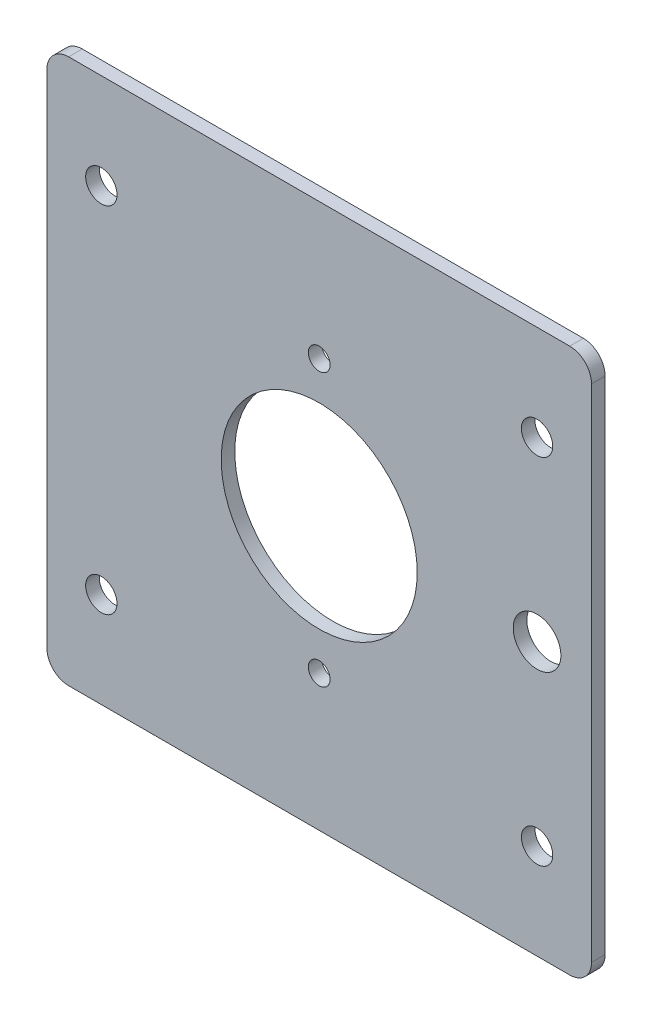
ISO-10303-21;
HEADER;
FILE_DESCRIPTION(('STEP AP214'),'2;1');
FILE_NAME('part.step','',(''),(''),'','','');
FILE_SCHEMA(('AUTOMOTIVE_DESIGN { 1 0 10303 214 1 1 1 1 }'));
ENDSEC;
DATA;
#1=APPLICATION_CONTEXT('core data for automotive mechanical design processes');
#2=APPLICATION_PROTOCOL_DEFINITION('international standard','automotive_design',2000,#1);
#3=PRODUCT_CONTEXT('',#1,'mechanical');
#4=PRODUCT('Part','Part','',(#3));
#5=PRODUCT_RELATED_PRODUCT_CATEGORY('part','',(#4));
#6=PRODUCT_DEFINITION_FORMATION('','',#4);
#7=PRODUCT_DEFINITION_CONTEXT('part definition',#1,'design');
#8=PRODUCT_DEFINITION('design','',#6,#7);
#9=PRODUCT_DEFINITION_SHAPE('','',#8);
#10=(LENGTH_UNIT() NAMED_UNIT(*) SI_UNIT(.MILLI.,.METRE.));
#11=(NAMED_UNIT(*) PLANE_ANGLE_UNIT() SI_UNIT($,.RADIAN.));
#12=(NAMED_UNIT(*) SI_UNIT($,.STERADIAN.) SOLID_ANGLE_UNIT());
#13=UNCERTAINTY_MEASURE_WITH_UNIT(LENGTH_MEASURE(1.E-05),#10,'distance_accuracy_value','');
#14=(GEOMETRIC_REPRESENTATION_CONTEXT(3) GLOBAL_UNCERTAINTY_ASSIGNED_CONTEXT((#13)) GLOBAL_UNIT_ASSIGNED_CONTEXT((#10,
#11,#12)) REPRESENTATION_CONTEXT('',''));
#15=CARTESIAN_POINT('',(0.,0.,0.));
#16=DIRECTION('',(0.,0.,1.));
#17=DIRECTION('',(1.,0.,0.));
#18=AXIS2_PLACEMENT_3D('',#15,#16,#17);
#19=CARTESIAN_POINT('',(31.75,31.75,-1.5875));
#20=DIRECTION('',(0.,0.,1.));
#21=DIRECTION('',(1.,0.,0.));
#22=AXIS2_PLACEMENT_3D('',#19,#20,#21);
#23=PLANE('',#22);
#24=CARTESIAN_POINT('',(25.4,0.,-1.5875));
#25=DIRECTION('',(0.,0.,1.));
#26=DIRECTION('',(1.,0.,0.));
#27=AXIS2_PLACEMENT_3D('',#24,#25,#26);
#28=CIRCLE('',#27,2.77812499999999);
#29=CARTESIAN_POINT('',(28.178125,0.,-1.5875));
#30=VERTEX_POINT('',#29);
#31=EDGE_CURVE('E216',#30,#30,#28,.T.);
#32=ORIENTED_EDGE('',*,*,#31,.T.);
#33=EDGE_LOOP('',(#32));
#34=FACE_BOUND('',#33,.T.);
#35=CARTESIAN_POINT('',(0.,-15.875,-1.5875));
#36=DIRECTION('',(0.,0.,1.));
#37=DIRECTION('',(-1.,0.,0.));
#38=AXIS2_PLACEMENT_3D('',#35,#36,#37);
#39=CIRCLE('',#38,1.27);
#40=CARTESIAN_POINT('',(-1.27,-15.875,-1.5875));
#41=VERTEX_POINT('',#40);
#42=EDGE_CURVE('E212',#41,#41,#39,.T.);
#43=ORIENTED_EDGE('',*,*,#42,.T.);
#44=EDGE_LOOP('',(#43));
#45=FACE_BOUND('',#44,.T.);
#46=CARTESIAN_POINT('',(0.,15.875,-1.5875));
#47=DIRECTION('',(0.,0.,1.));
#48=DIRECTION('',(1.,0.,0.));
#49=AXIS2_PLACEMENT_3D('',#46,#47,#48);
#50=CIRCLE('',#49,1.27);
#51=CARTESIAN_POINT('',(1.27,15.875,-1.5875));
#52=VERTEX_POINT('',#51);
#53=EDGE_CURVE('E219',#52,#52,#50,.T.);
#54=ORIENTED_EDGE('',*,*,#53,.T.);
#55=EDGE_LOOP('',(#54));
#56=FACE_BOUND('',#55,.T.);
#57=CARTESIAN_POINT('',(0.,0.,-1.5875));
#58=DIRECTION('',(0.,0.,1.));
#59=DIRECTION('',(1.,0.,0.));
#60=AXIS2_PLACEMENT_3D('',#57,#58,#59);
#61=CIRCLE('',#60,11.43);
#62=CARTESIAN_POINT('',(11.43,0.,-1.5875));
#63=VERTEX_POINT('',#62);
#64=EDGE_CURVE('E205',#63,#63,#61,.T.);
#65=ORIENTED_EDGE('',*,*,#64,.T.);
#66=EDGE_LOOP('',(#65));
#67=FACE_BOUND('',#66,.T.);
#68=CARTESIAN_POINT('',(-25.4,20.6375,-1.5875));
#69=DIRECTION('',(0.,0.,1.));
#70=DIRECTION('',(1.,0.,0.));
#71=AXIS2_PLACEMENT_3D('',#68,#69,#70);
#72=CIRCLE('',#71,1.8288);
#73=CARTESIAN_POINT('',(-23.5712,20.6375,-1.5875));
#74=VERTEX_POINT('',#73);
#75=EDGE_CURVE('E199',#74,#74,#72,.T.);
#76=ORIENTED_EDGE('',*,*,#75,.T.);
#77=EDGE_LOOP('',(#76));
#78=FACE_BOUND('',#77,.T.);
#79=CARTESIAN_POINT('',(25.4,20.6375,-1.5875));
#80=DIRECTION('',(0.,0.,1.));
#81=DIRECTION('',(1.,0.,0.));
#82=AXIS2_PLACEMENT_3D('',#79,#80,#81);
#83=CIRCLE('',#82,1.8288);
#84=CARTESIAN_POINT('',(27.2288,20.6375,-1.5875));
#85=VERTEX_POINT('',#84);
#86=EDGE_CURVE('E193',#85,#85,#83,.T.);
#87=ORIENTED_EDGE('',*,*,#86,.T.);
#88=EDGE_LOOP('',(#87));
#89=FACE_BOUND('',#88,.T.);
#90=CARTESIAN_POINT('',(25.4,-20.6375,-1.5875));
#91=DIRECTION('',(0.,0.,1.));
#92=DIRECTION('',(1.,0.,0.));
#93=AXIS2_PLACEMENT_3D('',#90,#91,#92);
#94=CIRCLE('',#93,1.8288);
#95=CARTESIAN_POINT('',(27.2288,-20.6375,-1.5875));
#96=VERTEX_POINT('',#95);
#97=EDGE_CURVE('E187',#96,#96,#94,.T.);
#98=ORIENTED_EDGE('',*,*,#97,.T.);
#99=EDGE_LOOP('',(#98));
#100=FACE_BOUND('',#99,.T.);
#101=CARTESIAN_POINT('',(-25.4,-20.6375,-1.5875));
#102=DIRECTION('',(0.,0.,1.));
#103=DIRECTION('',(1.,0.,0.));
#104=AXIS2_PLACEMENT_3D('',#101,#102,#103);
#105=CIRCLE('',#104,1.8288);
#106=CARTESIAN_POINT('',(-23.5712,-20.6375,-1.5875));
#107=VERTEX_POINT('',#106);
#108=EDGE_CURVE('E128',#107,#107,#105,.T.);
#109=ORIENTED_EDGE('',*,*,#108,.T.);
#110=EDGE_LOOP('',(#109));
#111=FACE_BOUND('',#110,.T.);
#112=DIRECTION('',(0.,-1.,0.));
#113=VECTOR('',#112,1.);
#114=CARTESIAN_POINT('',(31.75,31.75,-1.5875));
#115=LINE('',#114,#113);
#116=CARTESIAN_POINT('',(31.75,29.21,-1.5875));
#117=VERTEX_POINT('',#116);
#118=CARTESIAN_POINT('',(31.75,-29.21,-1.5875));
#119=VERTEX_POINT('',#118);
#120=EDGE_CURVE('E111',#117,#119,#115,.T.);
#121=ORIENTED_EDGE('',*,*,#120,.T.);
#122=CARTESIAN_POINT('',(29.21,-29.21,-1.5875));
#123=DIRECTION('',(0.,0.,1.));
#124=DIRECTION('',(1.,0.,0.));
#125=AXIS2_PLACEMENT_3D('',#122,#123,#124);
#126=CIRCLE('',#125,2.54);
#127=CARTESIAN_POINT('',(29.21,-31.75,-1.5875));
#128=VERTEX_POINT('',#127);
#129=EDGE_CURVE('E107',#119,#128,#126,.F.);
#130=ORIENTED_EDGE('',*,*,#129,.T.);
#131=DIRECTION('',(-1.,0.,0.));
#132=VECTOR('',#131,1.);
#133=CARTESIAN_POINT('',(31.75,-31.75,-1.5875));
#134=LINE('',#133,#132);
#135=CARTESIAN_POINT('',(-29.21,-31.75,-1.58749999999999));
#136=VERTEX_POINT('',#135);
#137=EDGE_CURVE('E109',#128,#136,#134,.T.);
#138=ORIENTED_EDGE('',*,*,#137,.T.);
#139=CARTESIAN_POINT('',(-29.21,-29.21,-1.58749999999999));
#140=DIRECTION('',(0.,0.,1.));
#141=DIRECTION('',(1.,0.,0.));
#142=AXIS2_PLACEMENT_3D('',#139,#140,#141);
#143=CIRCLE('',#142,2.54);
#144=CARTESIAN_POINT('',(-31.75,-29.21,-1.58749999999999));
#145=VERTEX_POINT('',#144);
#146=EDGE_CURVE('E116',#136,#145,#143,.F.);
#147=ORIENTED_EDGE('',*,*,#146,.T.);
#148=DIRECTION('',(0.,-1.,0.));
#149=VECTOR('',#148,1.);
#150=CARTESIAN_POINT('',(-31.75,31.75,-1.58749999999999));
#151=LINE('',#150,#149);
#152=CARTESIAN_POINT('',(-31.75,29.21,-1.58749999999999));
#153=VERTEX_POINT('',#152);
#154=EDGE_CURVE('E136',#153,#145,#151,.T.);
#155=ORIENTED_EDGE('',*,*,#154,.F.);
#156=CARTESIAN_POINT('',(-29.21,29.21,-1.58749999999999));
#157=DIRECTION('',(0.,0.,1.));
#158=DIRECTION('',(1.,0.,0.));
#159=AXIS2_PLACEMENT_3D('',#156,#157,#158);
#160=CIRCLE('',#159,2.54);
#161=CARTESIAN_POINT('',(-29.21,31.75,-1.58749999999999));
#162=VERTEX_POINT('',#161);
#163=EDGE_CURVE('E58',#153,#162,#160,.F.);
#164=ORIENTED_EDGE('',*,*,#163,.T.);
#165=DIRECTION('',(-1.,0.,0.));
#166=VECTOR('',#165,1.);
#167=CARTESIAN_POINT('',(31.75,31.75,-1.5875));
#168=LINE('',#167,#166);
#169=CARTESIAN_POINT('',(29.21,31.75,-1.5875));
#170=VERTEX_POINT('',#169);
#171=EDGE_CURVE('E178',#170,#162,#168,.T.);
#172=ORIENTED_EDGE('',*,*,#171,.F.);
#173=CARTESIAN_POINT('',(29.21,29.21,-1.5875));
#174=DIRECTION('',(0.,0.,1.));
#175=DIRECTION('',(1.,0.,0.));
#176=AXIS2_PLACEMENT_3D('',#173,#174,#175);
#177=CIRCLE('',#176,2.54);
#178=EDGE_CURVE('E149',#170,#117,#177,.F.);
#179=ORIENTED_EDGE('',*,*,#178,.T.);
#180=EDGE_LOOP('',(#121,#130,#138,#147,#155,#164,#172,#179));
#181=FACE_BOUND('',#180,.T.);
#182=ADVANCED_FACE('F43',(#34,#45,#56,#67,#78,#89,#100,#111,#181),#23,.F.);
#183=CARTESIAN_POINT('',(-31.75,31.75,0.));
#184=DIRECTION('',(-1.,0.,0.));
#185=DIRECTION('',(0.,0.,1.));
#186=AXIS2_PLACEMENT_3D('',#183,#184,#185);
#187=PLANE('',#186);
#188=ORIENTED_EDGE('',*,*,#154,.T.);
#189=DIRECTION('',(0.,0.,-1.));
#190=VECTOR('',#189,1.);
#191=CARTESIAN_POINT('',(-31.75,-29.21,0.));
#192=LINE('',#191,#190);
#193=CARTESIAN_POINT('',(-31.75,-29.21,0.));
#194=VERTEX_POINT('',#193);
#195=EDGE_CURVE('E155',#145,#194,#192,.F.);
#196=ORIENTED_EDGE('',*,*,#195,.T.);
#197=DIRECTION('',(0.,-1.,0.));
#198=VECTOR('',#197,1.);
#199=CARTESIAN_POINT('',(-31.75,31.75,0.));
#200=LINE('',#199,#198);
#201=CARTESIAN_POINT('',(-31.75,29.21,0.));
#202=VERTEX_POINT('',#201);
#203=EDGE_CURVE('E162',#202,#194,#200,.T.);
#204=ORIENTED_EDGE('',*,*,#203,.F.);
#205=DIRECTION('',(0.,0.,-1.));
#206=VECTOR('',#205,1.);
#207=CARTESIAN_POINT('',(-31.75,29.21,-1.58749999999999));
#208=LINE('',#207,#206);
#209=EDGE_CURVE('E115',#202,#153,#208,.T.);
#210=ORIENTED_EDGE('',*,*,#209,.T.);
#211=EDGE_LOOP('',(#188,#196,#204,#210));
#212=FACE_BOUND('',#211,.T.);
#213=ADVANCED_FACE('F161',(#212),#187,.T.);
#214=CARTESIAN_POINT('',(31.75,31.75,0.));
#215=DIRECTION('',(0.,0.,1.));
#216=DIRECTION('',(1.,0.,0.));
#217=AXIS2_PLACEMENT_3D('',#214,#215,#216);
#218=PLANE('',#217);
#219=CARTESIAN_POINT('',(25.4,0.,0.));
#220=DIRECTION('',(0.,0.,1.));
#221=DIRECTION('',(1.,0.,0.));
#222=AXIS2_PLACEMENT_3D('',#219,#220,#221);
#223=CIRCLE('',#222,2.77812499999999);
#224=CARTESIAN_POINT('',(28.178125,0.,0.));
#225=VERTEX_POINT('',#224);
#226=EDGE_CURVE('E226',#225,#225,#223,.T.);
#227=ORIENTED_EDGE('',*,*,#226,.F.);
#228=EDGE_LOOP('',(#227));
#229=FACE_BOUND('',#228,.T.);
#230=CARTESIAN_POINT('',(0.,-15.875,0.));
#231=DIRECTION('',(0.,0.,1.));
#232=DIRECTION('',(-1.,0.,0.));
#233=AXIS2_PLACEMENT_3D('',#230,#231,#232);
#234=CIRCLE('',#233,1.27);
#235=CARTESIAN_POINT('',(-1.27,-15.875,0.));
#236=VERTEX_POINT('',#235);
#237=EDGE_CURVE('E215',#236,#236,#234,.T.);
#238=ORIENTED_EDGE('',*,*,#237,.F.);
#239=EDGE_LOOP('',(#238));
#240=FACE_BOUND('',#239,.T.);
#241=CARTESIAN_POINT('',(0.,15.875,0.));
#242=DIRECTION('',(0.,0.,1.));
#243=DIRECTION('',(1.,0.,0.));
#244=AXIS2_PLACEMENT_3D('',#241,#242,#243);
#245=CIRCLE('',#244,1.27);
#246=CARTESIAN_POINT('',(1.27,15.875,0.));
#247=VERTEX_POINT('',#246);
#248=EDGE_CURVE('E209',#247,#247,#245,.T.);
#249=ORIENTED_EDGE('',*,*,#248,.F.);
#250=EDGE_LOOP('',(#249));
#251=FACE_BOUND('',#250,.T.);
#252=CARTESIAN_POINT('',(0.,0.,0.));
#253=DIRECTION('',(0.,0.,1.));
#254=DIRECTION('',(1.,0.,0.));
#255=AXIS2_PLACEMENT_3D('',#252,#253,#254);
#256=CIRCLE('',#255,11.43);
#257=CARTESIAN_POINT('',(11.43,0.,0.));
#258=VERTEX_POINT('',#257);
#259=EDGE_CURVE('E206',#258,#258,#256,.T.);
#260=ORIENTED_EDGE('',*,*,#259,.F.);
#261=EDGE_LOOP('',(#260));
#262=FACE_BOUND('',#261,.T.);
#263=CARTESIAN_POINT('',(-25.4,20.6375,0.));
#264=DIRECTION('',(0.,0.,1.));
#265=DIRECTION('',(1.,0.,0.));
#266=AXIS2_PLACEMENT_3D('',#263,#264,#265);
#267=CIRCLE('',#266,1.82879999999999);
#268=CARTESIAN_POINT('',(-23.5712,20.6375,0.));
#269=VERTEX_POINT('',#268);
#270=EDGE_CURVE('E202',#269,#269,#267,.T.);
#271=ORIENTED_EDGE('',*,*,#270,.F.);
#272=EDGE_LOOP('',(#271));
#273=FACE_BOUND('',#272,.T.);
#274=CARTESIAN_POINT('',(25.4,20.6375,0.));
#275=DIRECTION('',(0.,0.,1.));
#276=DIRECTION('',(1.,0.,0.));
#277=AXIS2_PLACEMENT_3D('',#274,#275,#276);
#278=CIRCLE('',#277,1.82879999999999);
#279=CARTESIAN_POINT('',(27.2288,20.6375,0.));
#280=VERTEX_POINT('',#279);
#281=EDGE_CURVE('E196',#280,#280,#278,.T.);
#282=ORIENTED_EDGE('',*,*,#281,.F.);
#283=EDGE_LOOP('',(#282));
#284=FACE_BOUND('',#283,.T.);
#285=CARTESIAN_POINT('',(25.4,-20.6375,0.));
#286=DIRECTION('',(0.,0.,1.));
#287=DIRECTION('',(1.,0.,0.));
#288=AXIS2_PLACEMENT_3D('',#285,#286,#287);
#289=CIRCLE('',#288,1.82879999999999);
#290=CARTESIAN_POINT('',(27.2288,-20.6375,0.));
#291=VERTEX_POINT('',#290);
#292=EDGE_CURVE('E190',#291,#291,#289,.T.);
#293=ORIENTED_EDGE('',*,*,#292,.F.);
#294=EDGE_LOOP('',(#293));
#295=FACE_BOUND('',#294,.T.);
#296=CARTESIAN_POINT('',(-25.4,-20.6375,0.));
#297=DIRECTION('',(0.,0.,1.));
#298=DIRECTION('',(1.,0.,0.));
#299=AXIS2_PLACEMENT_3D('',#296,#297,#298);
#300=CIRCLE('',#299,1.82879999999999);
#301=CARTESIAN_POINT('',(-23.5712,-20.6375,0.));
#302=VERTEX_POINT('',#301);
#303=EDGE_CURVE('E184',#302,#302,#300,.T.);
#304=ORIENTED_EDGE('',*,*,#303,.F.);
#305=EDGE_LOOP('',(#304));
#306=FACE_BOUND('',#305,.T.);
#307=DIRECTION('',(-1.,0.,0.));
#308=VECTOR('',#307,1.);
#309=CARTESIAN_POINT('',(31.75,-31.75,0.));
#310=LINE('',#309,#308);
#311=CARTESIAN_POINT('',(29.21,-31.75,0.));
#312=VERTEX_POINT('',#311);
#313=CARTESIAN_POINT('',(-29.21,-31.75,0.));
#314=VERTEX_POINT('',#313);
#315=EDGE_CURVE('E127',#312,#314,#310,.T.);
#316=ORIENTED_EDGE('',*,*,#315,.F.);
#317=CARTESIAN_POINT('',(29.21,-29.21,0.));
#318=DIRECTION('',(0.,0.,1.));
#319=DIRECTION('',(1.,0.,0.));
#320=AXIS2_PLACEMENT_3D('',#317,#318,#319);
#321=CIRCLE('',#320,2.54);
#322=CARTESIAN_POINT('',(31.75,-29.21,0.));
#323=VERTEX_POINT('',#322);
#324=EDGE_CURVE('E131',#312,#323,#321,.T.);
#325=ORIENTED_EDGE('',*,*,#324,.T.);
#326=DIRECTION('',(0.,-1.,0.));
#327=VECTOR('',#326,1.);
#328=CARTESIAN_POINT('',(31.75,31.75,0.));
#329=LINE('',#328,#327);
#330=CARTESIAN_POINT('',(31.75,29.21,0.));
#331=VERTEX_POINT('',#330);
#332=EDGE_CURVE('E170',#331,#323,#329,.T.);
#333=ORIENTED_EDGE('',*,*,#332,.F.);
#334=CARTESIAN_POINT('',(29.21,29.21,0.));
#335=DIRECTION('',(0.,0.,1.));
#336=DIRECTION('',(1.,0.,0.));
#337=AXIS2_PLACEMENT_3D('',#334,#335,#336);
#338=CIRCLE('',#337,2.54);
#339=CARTESIAN_POINT('',(29.21,31.75,0.));
#340=VERTEX_POINT('',#339);
#341=EDGE_CURVE('E132',#331,#340,#338,.T.);
#342=ORIENTED_EDGE('',*,*,#341,.T.);
#343=DIRECTION('',(-1.,0.,0.));
#344=VECTOR('',#343,1.);
#345=CARTESIAN_POINT('',(31.75,31.75,0.));
#346=LINE('',#345,#344);
#347=CARTESIAN_POINT('',(-29.21,31.75,0.));
#348=VERTEX_POINT('',#347);
#349=EDGE_CURVE('E177',#340,#348,#346,.T.);
#350=ORIENTED_EDGE('',*,*,#349,.T.);
#351=CARTESIAN_POINT('',(-29.21,29.21,0.));
#352=DIRECTION('',(0.,0.,1.));
#353=DIRECTION('',(1.,0.,0.));
#354=AXIS2_PLACEMENT_3D('',#351,#352,#353);
#355=CIRCLE('',#354,2.54);
#356=EDGE_CURVE('E134',#348,#202,#355,.T.);
#357=ORIENTED_EDGE('',*,*,#356,.T.);
#358=ORIENTED_EDGE('',*,*,#203,.T.);
#359=CARTESIAN_POINT('',(-29.21,-29.21,0.));
#360=DIRECTION('',(0.,0.,1.));
#361=DIRECTION('',(1.,0.,0.));
#362=AXIS2_PLACEMENT_3D('',#359,#360,#361);
#363=CIRCLE('',#362,2.54);
#364=EDGE_CURVE('E141',#194,#314,#363,.T.);
#365=ORIENTED_EDGE('',*,*,#364,.T.);
#366=EDGE_LOOP('',(#316,#325,#333,#342,#350,#357,#358,#365));
#367=FACE_BOUND('',#366,.T.);
#368=ADVANCED_FACE('F167',(#229,#240,#251,#262,#273,#284,#295,#306,#367),#218,.T.);
#369=CARTESIAN_POINT('',(31.75,31.75,-1.5875));
#370=DIRECTION('',(1.,0.,0.));
#371=DIRECTION('',(0.,0.,-1.));
#372=AXIS2_PLACEMENT_3D('',#369,#370,#371);
#373=PLANE('',#372);
#374=ORIENTED_EDGE('',*,*,#332,.T.);
#375=DIRECTION('',(0.,0.,1.));
#376=VECTOR('',#375,1.);
#377=CARTESIAN_POINT('',(31.75,-29.21,-1.5875));
#378=LINE('',#377,#376);
#379=EDGE_CURVE('E147',#323,#119,#378,.F.);
#380=ORIENTED_EDGE('',*,*,#379,.T.);
#381=ORIENTED_EDGE('',*,*,#120,.F.);
#382=DIRECTION('',(0.,0.,1.));
#383=VECTOR('',#382,1.);
#384=CARTESIAN_POINT('',(31.75,29.21,0.));
#385=LINE('',#384,#383);
#386=EDGE_CURVE('E144',#117,#331,#385,.T.);
#387=ORIENTED_EDGE('',*,*,#386,.T.);
#388=EDGE_LOOP('',(#374,#380,#381,#387));
#389=FACE_BOUND('',#388,.T.);
#390=ADVANCED_FACE('F234',(#389),#373,.T.);
#391=CARTESIAN_POINT('',(0.,31.75,0.));
#392=DIRECTION('',(0.,-1.,0.));
#393=DIRECTION('',(1.,0.,0.));
#394=AXIS2_PLACEMENT_3D('',#391,#392,#393);
#395=PLANE('',#394);
#396=ORIENTED_EDGE('',*,*,#171,.T.);
#397=DIRECTION('',(0.,0.,-1.));
#398=VECTOR('',#397,1.);
#399=CARTESIAN_POINT('',(-29.21,31.75,0.));
#400=LINE('',#399,#398);
#401=EDGE_CURVE('E11',#162,#348,#400,.F.);
#402=ORIENTED_EDGE('',*,*,#401,.T.);
#403=ORIENTED_EDGE('',*,*,#349,.F.);
#404=DIRECTION('',(0.,0.,1.));
#405=VECTOR('',#404,1.);
#406=CARTESIAN_POINT('',(29.21,31.75,-1.5875));
#407=LINE('',#406,#405);
#408=EDGE_CURVE('E51',#340,#170,#407,.F.);
#409=ORIENTED_EDGE('',*,*,#408,.T.);
#410=EDGE_LOOP('',(#396,#402,#403,#409));
#411=FACE_BOUND('',#410,.T.);
#412=ADVANCED_FACE('F284',(#411),#395,.F.);
#413=CARTESIAN_POINT('',(0.,-31.75,0.));
#414=DIRECTION('',(0.,-1.,0.));
#415=DIRECTION('',(1.,0.,0.));
#416=AXIS2_PLACEMENT_3D('',#413,#414,#415);
#417=PLANE('',#416);
#418=ORIENTED_EDGE('',*,*,#137,.F.);
#419=DIRECTION('',(0.,0.,1.));
#420=VECTOR('',#419,1.);
#421=CARTESIAN_POINT('',(29.21,-31.75,0.));
#422=LINE('',#421,#420);
#423=EDGE_CURVE('E123',#128,#312,#422,.T.);
#424=ORIENTED_EDGE('',*,*,#423,.T.);
#425=ORIENTED_EDGE('',*,*,#315,.T.);
#426=DIRECTION('',(0.,0.,-1.));
#427=VECTOR('',#426,1.);
#428=CARTESIAN_POINT('',(-29.21,-31.75,0.));
#429=LINE('',#428,#427);
#430=EDGE_CURVE('E126',#314,#136,#429,.T.);
#431=ORIENTED_EDGE('',*,*,#430,.T.);
#432=EDGE_LOOP('',(#418,#424,#425,#431));
#433=FACE_BOUND('',#432,.T.);
#434=ADVANCED_FACE('F121',(#433),#417,.T.);
#435=CARTESIAN_POINT('',(29.21,-29.21,0.));
#436=DIRECTION('',(0.,0.,1.));
#437=DIRECTION('',(1.,0.,0.));
#438=AXIS2_PLACEMENT_3D('',#435,#436,#437);
#439=CYLINDRICAL_SURFACE('',#438,2.54);
#440=ORIENTED_EDGE('',*,*,#129,.F.);
#441=ORIENTED_EDGE('',*,*,#379,.F.);
#442=ORIENTED_EDGE('',*,*,#324,.F.);
#443=ORIENTED_EDGE('',*,*,#423,.F.);
#444=EDGE_LOOP('',(#440,#441,#442,#443));
#445=FACE_BOUND('',#444,.T.);
#446=ADVANCED_FACE('F130',(#445),#439,.T.);
#447=CARTESIAN_POINT('',(-29.21,-29.21,0.));
#448=DIRECTION('',(0.,0.,-1.));
#449=DIRECTION('',(-1.,0.,0.));
#450=AXIS2_PLACEMENT_3D('',#447,#448,#449);
#451=CYLINDRICAL_SURFACE('',#450,2.54);
#452=ORIENTED_EDGE('',*,*,#364,.F.);
#453=ORIENTED_EDGE('',*,*,#195,.F.);
#454=ORIENTED_EDGE('',*,*,#146,.F.);
#455=ORIENTED_EDGE('',*,*,#430,.F.);
#456=EDGE_LOOP('',(#452,#453,#454,#455));
#457=FACE_BOUND('',#456,.T.);
#458=ADVANCED_FACE('F172',(#457),#451,.T.);
#459=CARTESIAN_POINT('',(-29.21,29.21,0.));
#460=DIRECTION('',(0.,0.,1.));
#461=DIRECTION('',(1.,0.,0.));
#462=AXIS2_PLACEMENT_3D('',#459,#460,#461);
#463=CYLINDRICAL_SURFACE('',#462,2.54);
#464=ORIENTED_EDGE('',*,*,#356,.F.);
#465=ORIENTED_EDGE('',*,*,#401,.F.);
#466=ORIENTED_EDGE('',*,*,#163,.F.);
#467=ORIENTED_EDGE('',*,*,#209,.F.);
#468=EDGE_LOOP('',(#464,#465,#466,#467));
#469=FACE_BOUND('',#468,.T.);
#470=ADVANCED_FACE('F262',(#469),#463,.T.);
#471=CARTESIAN_POINT('',(29.21,29.21,-1.5875));
#472=DIRECTION('',(0.,0.,-1.));
#473=DIRECTION('',(-1.,0.,0.));
#474=AXIS2_PLACEMENT_3D('',#471,#472,#473);
#475=CYLINDRICAL_SURFACE('',#474,2.54);
#476=ORIENTED_EDGE('',*,*,#178,.F.);
#477=ORIENTED_EDGE('',*,*,#408,.F.);
#478=ORIENTED_EDGE('',*,*,#341,.F.);
#479=ORIENTED_EDGE('',*,*,#386,.F.);
#480=EDGE_LOOP('',(#476,#477,#478,#479));
#481=FACE_BOUND('',#480,.T.);
#482=ADVANCED_FACE('F45',(#481),#475,.T.);
#483=CARTESIAN_POINT('',(-25.4,-20.6375,0.));
#484=DIRECTION('',(0.,0.,1.));
#485=DIRECTION('',(1.,0.,0.));
#486=AXIS2_PLACEMENT_3D('',#483,#484,#485);
#487=CYLINDRICAL_SURFACE('',#486,1.82879999999999);
#488=ORIENTED_EDGE('',*,*,#108,.F.);
#489=EDGE_LOOP('',(#488));
#490=FACE_BOUND('',#489,.T.);
#491=ORIENTED_EDGE('',*,*,#303,.T.);
#492=EDGE_LOOP('',(#491));
#493=FACE_BOUND('',#492,.T.);
#494=ADVANCED_FACE('F250',(#490,#493),#487,.F.);
#495=CARTESIAN_POINT('',(25.4,-20.6375,0.));
#496=DIRECTION('',(0.,0.,1.));
#497=DIRECTION('',(1.,0.,0.));
#498=AXIS2_PLACEMENT_3D('',#495,#496,#497);
#499=CYLINDRICAL_SURFACE('',#498,1.82879999999999);
#500=ORIENTED_EDGE('',*,*,#97,.F.);
#501=EDGE_LOOP('',(#500));
#502=FACE_BOUND('',#501,.T.);
#503=ORIENTED_EDGE('',*,*,#292,.T.);
#504=EDGE_LOOP('',(#503));
#505=FACE_BOUND('',#504,.T.);
#506=ADVANCED_FACE('F252',(#502,#505),#499,.F.);
#507=CARTESIAN_POINT('',(25.4,20.6375,0.));
#508=DIRECTION('',(0.,0.,1.));
#509=DIRECTION('',(1.,0.,0.));
#510=AXIS2_PLACEMENT_3D('',#507,#508,#509);
#511=CYLINDRICAL_SURFACE('',#510,1.82879999999999);
#512=ORIENTED_EDGE('',*,*,#86,.F.);
#513=EDGE_LOOP('',(#512));
#514=FACE_BOUND('',#513,.T.);
#515=ORIENTED_EDGE('',*,*,#281,.T.);
#516=EDGE_LOOP('',(#515));
#517=FACE_BOUND('',#516,.T.);
#518=ADVANCED_FACE('F259',(#514,#517),#511,.F.);
#519=CARTESIAN_POINT('',(-25.4,20.6375,0.));
#520=DIRECTION('',(0.,0.,1.));
#521=DIRECTION('',(1.,0.,0.));
#522=AXIS2_PLACEMENT_3D('',#519,#520,#521);
#523=CYLINDRICAL_SURFACE('',#522,1.82879999999999);
#524=ORIENTED_EDGE('',*,*,#75,.F.);
#525=EDGE_LOOP('',(#524));
#526=FACE_BOUND('',#525,.T.);
#527=ORIENTED_EDGE('',*,*,#270,.T.);
#528=EDGE_LOOP('',(#527));
#529=FACE_BOUND('',#528,.T.);
#530=ADVANCED_FACE('F340',(#526,#529),#523,.F.);
#531=CARTESIAN_POINT('',(0.,0.,-1.5875));
#532=DIRECTION('',(0.,0.,1.));
#533=DIRECTION('',(1.,0.,0.));
#534=AXIS2_PLACEMENT_3D('',#531,#532,#533);
#535=CYLINDRICAL_SURFACE('',#534,11.43);
#536=ORIENTED_EDGE('',*,*,#64,.F.);
#537=EDGE_LOOP('',(#536));
#538=FACE_BOUND('',#537,.T.);
#539=ORIENTED_EDGE('',*,*,#259,.T.);
#540=EDGE_LOOP('',(#539));
#541=FACE_BOUND('',#540,.T.);
#542=ADVANCED_FACE('F350',(#538,#541),#535,.F.);
#543=CARTESIAN_POINT('',(0.,15.875,-1.5875));
#544=DIRECTION('',(0.,0.,1.));
#545=DIRECTION('',(1.,0.,0.));
#546=AXIS2_PLACEMENT_3D('',#543,#544,#545);
#547=CYLINDRICAL_SURFACE('',#546,1.27);
#548=ORIENTED_EDGE('',*,*,#53,.F.);
#549=EDGE_LOOP('',(#548));
#550=FACE_BOUND('',#549,.T.);
#551=ORIENTED_EDGE('',*,*,#248,.T.);
#552=EDGE_LOOP('',(#551));
#553=FACE_BOUND('',#552,.T.);
#554=ADVANCED_FACE('F360',(#550,#553),#547,.F.);
#555=CARTESIAN_POINT('',(0.,-15.875,-1.5875));
#556=DIRECTION('',(0.,0.,1.));
#557=DIRECTION('',(1.,0.,0.));
#558=AXIS2_PLACEMENT_3D('',#555,#556,#557);
#559=CYLINDRICAL_SURFACE('',#558,1.27);
#560=ORIENTED_EDGE('',*,*,#42,.F.);
#561=EDGE_LOOP('',(#560));
#562=FACE_BOUND('',#561,.T.);
#563=ORIENTED_EDGE('',*,*,#237,.T.);
#564=EDGE_LOOP('',(#563));
#565=FACE_BOUND('',#564,.T.);
#566=ADVANCED_FACE('F371',(#562,#565),#559,.F.);
#567=CARTESIAN_POINT('',(25.4,0.,0.));
#568=DIRECTION('',(0.,0.,1.));
#569=DIRECTION('',(1.,0.,0.));
#570=AXIS2_PLACEMENT_3D('',#567,#568,#569);
#571=CYLINDRICAL_SURFACE('',#570,2.77812499999999);
#572=ORIENTED_EDGE('',*,*,#31,.F.);
#573=EDGE_LOOP('',(#572));
#574=FACE_BOUND('',#573,.T.);
#575=ORIENTED_EDGE('',*,*,#226,.T.);
#576=EDGE_LOOP('',(#575));
#577=FACE_BOUND('',#576,.T.);
#578=ADVANCED_FACE('F230',(#574,#577),#571,.F.);
#579=CLOSED_SHELL('',(#182,#213,#368,#390,#412,#434,#446,#458,#470,#482,#494,#506,#518,#530,
#542,#554,#566,#578));
#580=MANIFOLD_SOLID_BREP('B2',#579);
#581=ADVANCED_BREP_SHAPE_REPRESENTATION('',(#18,#580),#14);
#582=SHAPE_DEFINITION_REPRESENTATION(#9,#581);
ENDSEC;
END-ISO-10303-21;
